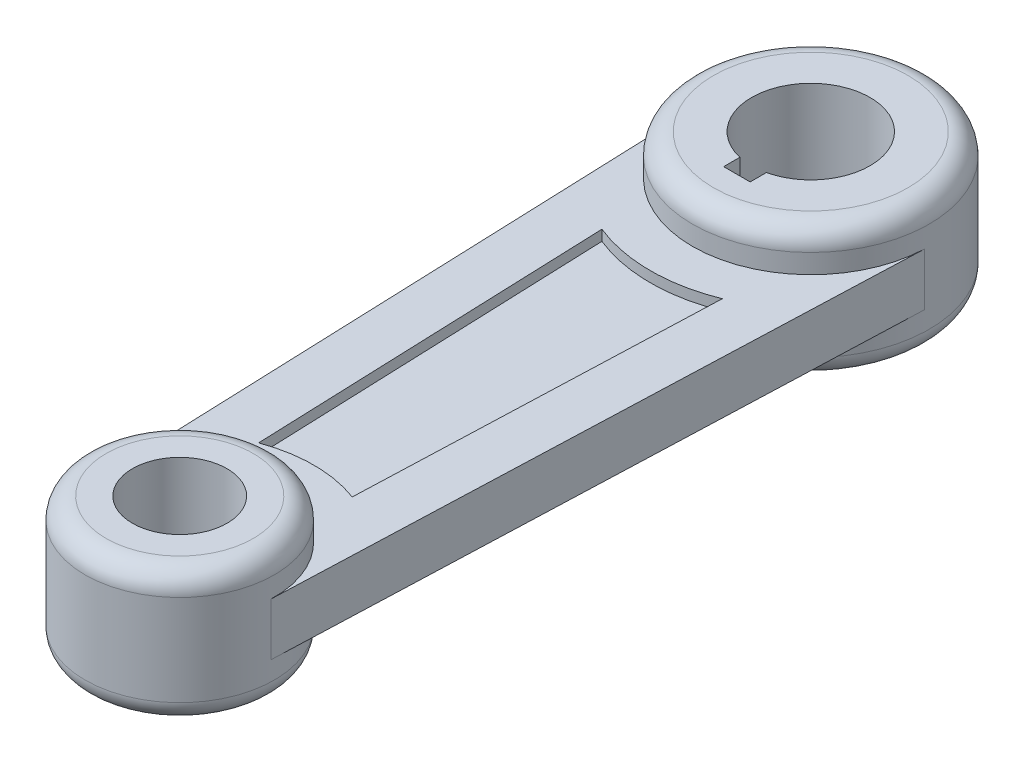
ISO-10303-21;
HEADER;
FILE_DESCRIPTION(('STEP AP214'),'2;1');
FILE_NAME('part.step','',(''),(''),'','','');
FILE_SCHEMA(('AUTOMOTIVE_DESIGN { 1 0 10303 214 1 1 1 1 }'));
ENDSEC;
DATA;
#1=APPLICATION_CONTEXT('core data for automotive mechanical design processes');
#2=APPLICATION_PROTOCOL_DEFINITION('international standard','automotive_design',2000,#1);
#3=PRODUCT_CONTEXT('',#1,'mechanical');
#4=PRODUCT('Part','Part','',(#3));
#5=PRODUCT_RELATED_PRODUCT_CATEGORY('part','',(#4));
#6=PRODUCT_DEFINITION_FORMATION('','',#4);
#7=PRODUCT_DEFINITION_CONTEXT('part definition',#1,'design');
#8=PRODUCT_DEFINITION('design','',#6,#7);
#9=PRODUCT_DEFINITION_SHAPE('','',#8);
#10=(LENGTH_UNIT() NAMED_UNIT(*) SI_UNIT(.MILLI.,.METRE.));
#11=(NAMED_UNIT(*) PLANE_ANGLE_UNIT() SI_UNIT($,.RADIAN.));
#12=(NAMED_UNIT(*) SI_UNIT($,.STERADIAN.) SOLID_ANGLE_UNIT());
#13=UNCERTAINTY_MEASURE_WITH_UNIT(LENGTH_MEASURE(1.E-05),#10,'distance_accuracy_value','');
#14=(GEOMETRIC_REPRESENTATION_CONTEXT(3) GLOBAL_UNCERTAINTY_ASSIGNED_CONTEXT((#13)) GLOBAL_UNIT_ASSIGNED_CONTEXT((#10,
#11,#12)) REPRESENTATION_CONTEXT('',''));
#15=CARTESIAN_POINT('',(0.,0.,0.));
#16=DIRECTION('',(0.,0.,1.));
#17=DIRECTION('',(1.,0.,0.));
#18=AXIS2_PLACEMENT_3D('',#15,#16,#17);
#19=CARTESIAN_POINT('',(0.,-12.5,-300.));
#20=DIRECTION('',(0.,1.,0.));
#21=DIRECTION('',(0.,0.,1.));
#22=AXIS2_PLACEMENT_3D('',#19,#20,#21);
#23=PLANE('',#22);
#24=CARTESIAN_POINT('',(0.,-12.5,-300.));
#25=DIRECTION('',(0.,-1.,0.));
#26=DIRECTION('',(0.,0.,1.));
#27=AXIS2_PLACEMENT_3D('',#24,#25,#26);
#28=CIRCLE('',#27,56.25);
#29=CARTESIAN_POINT('',(56.2104353043932,-12.5,-297.890625));
#30=VERTEX_POINT('',#29);
#31=CARTESIAN_POINT('',(-56.2104353043932,-12.5,-297.890625));
#32=VERTEX_POINT('',#31);
#33=EDGE_CURVE('E184',#30,#32,#28,.T.);
#34=ORIENTED_EDGE('',*,*,#33,.F.);
#35=DIRECTION('',(0.0374999999999999,0.,-0.999296627633657));
#36=VECTOR('',#35,1.);
#37=CARTESIAN_POINT('',(56.2104353043932,-12.5,-297.890625));
#38=LINE('',#37,#36);
#39=CARTESIAN_POINT('',(44.9683482435146,-12.5,1.68749999999999));
#40=VERTEX_POINT('',#39);
#41=EDGE_CURVE('E203',#40,#30,#38,.T.);
#42=ORIENTED_EDGE('',*,*,#41,.F.);
#43=CARTESIAN_POINT('',(0.,-12.5,0.));
#44=DIRECTION('',(0.,-1.,0.));
#45=DIRECTION('',(0.,0.,1.));
#46=AXIS2_PLACEMENT_3D('',#43,#44,#45);
#47=CIRCLE('',#46,45.);
#48=CARTESIAN_POINT('',(-44.9683482435146,-12.5,1.6875));
#49=VERTEX_POINT('',#48);
#50=EDGE_CURVE('E218',#49,#40,#47,.T.);
#51=ORIENTED_EDGE('',*,*,#50,.F.);
#52=DIRECTION('',(0.0374999999999999,0.,0.999296627633657));
#53=VECTOR('',#52,1.);
#54=CARTESIAN_POINT('',(-44.9683482435146,-12.5,1.6875));
#55=LINE('',#54,#53);
#56=EDGE_CURVE('E190',#32,#49,#55,.T.);
#57=ORIENTED_EDGE('',*,*,#56,.F.);
#58=EDGE_LOOP('',(#34,#42,#51,#57));
#59=FACE_BOUND('',#58,.T.);
#60=CARTESIAN_POINT('',(0.,-12.5,0.));
#61=DIRECTION('',(0.,-1.,0.));
#62=DIRECTION('',(0.,0.,1.));
#63=AXIS2_PLACEMENT_3D('',#60,#61,#62);
#64=CIRCLE('',#63,63.75);
#65=CARTESIAN_POINT('',(-22.2558638050738,-12.5,-59.7389238795779));
#66=VERTEX_POINT('',#65);
#67=CARTESIAN_POINT('',(22.2558638050737,-12.5,-59.7389238795779));
#68=VERTEX_POINT('',#67);
#69=EDGE_CURVE('E67',#66,#68,#64,.T.);
#70=ORIENTED_EDGE('',*,*,#69,.T.);
#71=DIRECTION('',(0.0374999999999998,0.,-0.999296627633657));
#72=VECTOR('',#71,1.);
#73=CARTESIAN_POINT('',(22.2558638050737,-12.5,-59.7389238795779));
#74=LINE('',#73,#72);
#75=CARTESIAN_POINT('',(28.6198144116935,-12.5,-229.324907336175));
#76=VERTEX_POINT('',#75);
#77=EDGE_CURVE('E655',#68,#76,#74,.T.);
#78=ORIENTED_EDGE('',*,*,#77,.T.);
#79=CARTESIAN_POINT('',(0.,-12.5,-300.));
#80=DIRECTION('',(0.,-1.,0.));
#81=DIRECTION('',(0.,0.,1.));
#82=AXIS2_PLACEMENT_3D('',#79,#80,#81);
#83=CIRCLE('',#82,76.25);
#84=CARTESIAN_POINT('',(-28.6198144116936,-12.5,-229.324907336175));
#85=VERTEX_POINT('',#84);
#86=EDGE_CURVE('E671',#76,#85,#83,.T.);
#87=ORIENTED_EDGE('',*,*,#86,.T.);
#88=DIRECTION('',(0.0374999999999998,0.,0.999296627633657));
#89=VECTOR('',#88,1.);
#90=CARTESIAN_POINT('',(-28.6198144116936,-12.5,-229.324907336175));
#91=LINE('',#90,#89);
#92=EDGE_CURVE('E667',#85,#66,#91,.T.);
#93=ORIENTED_EDGE('',*,*,#92,.T.);
#94=EDGE_LOOP('',(#70,#78,#87,#93));
#95=FACE_BOUND('',#94,.T.);
#96=ADVANCED_FACE('F43',(#59,#95),#23,.F.);
#97=CARTESIAN_POINT('',(0.,31.65,0.));
#98=DIRECTION('',(0.,1.,0.));
#99=DIRECTION('',(0.,0.,1.));
#100=AXIS2_PLACEMENT_3D('',#97,#98,#99);
#101=PLANE('',#100);
#102=CARTESIAN_POINT('',(0.,31.65,0.));
#103=DIRECTION('',(0.,1.,0.));
#104=DIRECTION('',(0.,0.,1.));
#105=AXIS2_PLACEMENT_3D('',#102,#103,#104);
#106=CIRCLE('',#105,35.);
#107=CARTESIAN_POINT('',(0.,31.65,35.));
#108=VERTEX_POINT('',#107);
#109=EDGE_CURVE('E256',#108,#108,#106,.T.);
#110=ORIENTED_EDGE('',*,*,#109,.T.);
#111=EDGE_LOOP('',(#110));
#112=FACE_BOUND('',#111,.T.);
#113=CARTESIAN_POINT('',(0.,31.65,0.));
#114=DIRECTION('',(0.,1.,0.));
#115=DIRECTION('',(0.,0.,1.));
#116=AXIS2_PLACEMENT_3D('',#113,#114,#115);
#117=CIRCLE('',#116,22.5);
#118=CARTESIAN_POINT('',(0.,31.65,22.5));
#119=VERTEX_POINT('',#118);
#120=EDGE_CURVE('E237',#119,#119,#117,.T.);
#121=ORIENTED_EDGE('',*,*,#120,.F.);
#122=EDGE_LOOP('',(#121));
#123=FACE_BOUND('',#122,.T.);
#124=ADVANCED_FACE('F314',(#112,#123),#101,.T.);
#125=CARTESIAN_POINT('',(0.,-31.65,0.));
#126=DIRECTION('',(0.,1.,0.));
#127=DIRECTION('',(0.,0.,1.));
#128=AXIS2_PLACEMENT_3D('',#125,#126,#127);
#129=PLANE('',#128);
#130=CARTESIAN_POINT('',(0.,-31.65,0.));
#131=DIRECTION('',(0.,1.,0.));
#132=DIRECTION('',(0.,0.,1.));
#133=AXIS2_PLACEMENT_3D('',#130,#131,#132);
#134=CIRCLE('',#133,35.);
#135=CARTESIAN_POINT('',(0.,-31.65,35.));
#136=VERTEX_POINT('',#135);
#137=EDGE_CURVE('E252',#136,#136,#134,.F.);
#138=ORIENTED_EDGE('',*,*,#137,.T.);
#139=EDGE_LOOP('',(#138));
#140=FACE_BOUND('',#139,.T.);
#141=CARTESIAN_POINT('',(0.,-31.65,0.));
#142=DIRECTION('',(0.,1.,0.));
#143=DIRECTION('',(0.,0.,1.));
#144=AXIS2_PLACEMENT_3D('',#141,#142,#143);
#145=CIRCLE('',#144,22.5);
#146=CARTESIAN_POINT('',(0.,-31.65,22.5));
#147=VERTEX_POINT('',#146);
#148=EDGE_CURVE('E236',#147,#147,#145,.T.);
#149=ORIENTED_EDGE('',*,*,#148,.T.);
#150=EDGE_LOOP('',(#149));
#151=FACE_BOUND('',#150,.T.);
#152=ADVANCED_FACE('F305',(#140,#151),#129,.F.);
#153=CARTESIAN_POINT('',(0.,31.65,0.));
#154=DIRECTION('',(0.,-1.,0.));
#155=DIRECTION('',(0.,0.,-1.));
#156=AXIS2_PLACEMENT_3D('',#153,#154,#155);
#157=CYLINDRICAL_SURFACE('',#156,45.);
#158=CARTESIAN_POINT('',(0.,-21.65,0.));
#159=DIRECTION('',(0.,1.,0.));
#160=DIRECTION('',(0.,0.,1.));
#161=AXIS2_PLACEMENT_3D('',#158,#159,#160);
#162=CIRCLE('',#161,45.);
#163=CARTESIAN_POINT('',(0.,-21.65,45.));
#164=VERTEX_POINT('',#163);
#165=EDGE_CURVE('E248',#164,#164,#162,.T.);
#166=ORIENTED_EDGE('',*,*,#165,.T.);
#167=EDGE_LOOP('',(#166));
#168=FACE_BOUND('',#167,.T.);
#169=CARTESIAN_POINT('',(0.,21.65,0.));
#170=DIRECTION('',(0.,1.,0.));
#171=DIRECTION('',(0.,0.,1.));
#172=AXIS2_PLACEMENT_3D('',#169,#170,#171);
#173=CIRCLE('',#172,45.);
#174=CARTESIAN_POINT('',(0.,21.65,45.));
#175=VERTEX_POINT('',#174);
#176=EDGE_CURVE('E241',#175,#175,#173,.F.);
#177=ORIENTED_EDGE('',*,*,#176,.T.);
#178=EDGE_LOOP('',(#177));
#179=FACE_BOUND('',#178,.T.);
#180=DIRECTION('',(0.,-1.,0.));
#181=VECTOR('',#180,1.);
#182=CARTESIAN_POINT('',(44.9683482435146,12.5,1.6875));
#183=LINE('',#182,#181);
#184=CARTESIAN_POINT('',(44.9683482435146,12.5,1.68749999999999));
#185=VERTEX_POINT('',#184);
#186=EDGE_CURVE('E226',#185,#40,#183,.T.);
#187=ORIENTED_EDGE('',*,*,#186,.F.);
#188=CARTESIAN_POINT('',(0.,12.5,0.));
#189=DIRECTION('',(0.,-1.,0.));
#190=DIRECTION('',(0.,0.,1.));
#191=AXIS2_PLACEMENT_3D('',#188,#189,#190);
#192=CIRCLE('',#191,45.);
#193=CARTESIAN_POINT('',(-44.9683482435146,12.5,1.68749999999999));
#194=VERTEX_POINT('',#193);
#195=EDGE_CURVE('E207',#194,#185,#192,.T.);
#196=ORIENTED_EDGE('',*,*,#195,.F.);
#197=DIRECTION('',(0.,-1.,0.));
#198=VECTOR('',#197,1.);
#199=CARTESIAN_POINT('',(-44.9683482435146,12.5,1.6875));
#200=LINE('',#199,#198);
#201=EDGE_CURVE('E230',#194,#49,#200,.T.);
#202=ORIENTED_EDGE('',*,*,#201,.T.);
#203=ORIENTED_EDGE('',*,*,#50,.T.);
#204=EDGE_LOOP('',(#187,#196,#202,#203));
#205=FACE_BOUND('',#204,.T.);
#206=ADVANCED_FACE('F302',(#168,#179,#205),#157,.T.);
#207=CARTESIAN_POINT('',(0.,31.65,0.));
#208=DIRECTION('',(0.,-1.,0.));
#209=DIRECTION('',(0.,0.,-1.));
#210=AXIS2_PLACEMENT_3D('',#207,#208,#209);
#211=CYLINDRICAL_SURFACE('',#210,22.5);
#212=ORIENTED_EDGE('',*,*,#120,.T.);
#213=EDGE_LOOP('',(#212));
#214=FACE_BOUND('',#213,.T.);
#215=ORIENTED_EDGE('',*,*,#148,.F.);
#216=EDGE_LOOP('',(#215));
#217=FACE_BOUND('',#216,.T.);
#218=ADVANCED_FACE('F304',(#214,#217),#211,.F.);
#219=CARTESIAN_POINT('',(-44.9683482435146,12.5,1.6875));
#220=DIRECTION('',(0.999296627633657,0.,-0.0374999999999999));
#221=DIRECTION('',(-0.0374999999999999,0.,-0.999296627633657));
#222=AXIS2_PLACEMENT_3D('',#219,#220,#221);
#223=PLANE('',#222);
#224=ORIENTED_EDGE('',*,*,#56,.T.);
#225=ORIENTED_EDGE('',*,*,#201,.F.);
#226=DIRECTION('',(0.0374999999999999,0.,0.999296627633657));
#227=VECTOR('',#226,1.);
#228=CARTESIAN_POINT('',(-44.9683482435146,12.5,1.6875));
#229=LINE('',#228,#227);
#230=CARTESIAN_POINT('',(-56.2104353043932,12.5,-297.890625));
#231=VERTEX_POINT('',#230);
#232=EDGE_CURVE('E202',#231,#194,#229,.T.);
#233=ORIENTED_EDGE('',*,*,#232,.F.);
#234=DIRECTION('',(0.,-1.,0.));
#235=VECTOR('',#234,1.);
#236=CARTESIAN_POINT('',(-56.2104353043932,12.5,-297.890625));
#237=LINE('',#236,#235);
#238=EDGE_CURVE('E233',#231,#32,#237,.T.);
#239=ORIENTED_EDGE('',*,*,#238,.T.);
#240=EDGE_LOOP('',(#224,#225,#233,#239));
#241=FACE_BOUND('',#240,.T.);
#242=ADVANCED_FACE('F300',(#241),#223,.F.);
#243=CARTESIAN_POINT('',(56.2104353043932,12.5,-297.890625));
#244=DIRECTION('',(-0.999296627633657,0.,-0.0374999999999999));
#245=DIRECTION('',(-0.0374999999999999,0.,0.999296627633657));
#246=AXIS2_PLACEMENT_3D('',#243,#244,#245);
#247=PLANE('',#246);
#248=ORIENTED_EDGE('',*,*,#41,.T.);
#249=DIRECTION('',(0.,-1.,0.));
#250=VECTOR('',#249,1.);
#251=CARTESIAN_POINT('',(56.2104353043932,12.5,-297.890625));
#252=LINE('',#251,#250);
#253=CARTESIAN_POINT('',(56.2104353043932,12.5,-297.890625));
#254=VERTEX_POINT('',#253);
#255=EDGE_CURVE('E213',#254,#30,#252,.T.);
#256=ORIENTED_EDGE('',*,*,#255,.F.);
#257=DIRECTION('',(0.0374999999999999,0.,-0.999296627633657));
#258=VECTOR('',#257,1.);
#259=CARTESIAN_POINT('',(56.2104353043932,12.5,-297.890625));
#260=LINE('',#259,#258);
#261=EDGE_CURVE('E211',#185,#254,#260,.T.);
#262=ORIENTED_EDGE('',*,*,#261,.F.);
#263=ORIENTED_EDGE('',*,*,#186,.T.);
#264=EDGE_LOOP('',(#248,#256,#262,#263));
#265=FACE_BOUND('',#264,.T.);
#266=ADVANCED_FACE('F292',(#265),#247,.F.);
#267=CARTESIAN_POINT('',(0.,12.5,-300.));
#268=DIRECTION('',(0.,1.,0.));
#269=DIRECTION('',(0.,0.,1.));
#270=AXIS2_PLACEMENT_3D('',#267,#268,#269);
#271=PLANE('',#270);
#272=CARTESIAN_POINT('',(0.,12.5,0.));
#273=DIRECTION('',(0.,-1.,0.));
#274=DIRECTION('',(0.,0.,1.));
#275=AXIS2_PLACEMENT_3D('',#272,#273,#274);
#276=CIRCLE('',#275,63.75);
#277=CARTESIAN_POINT('',(-22.2558638050738,12.5,-59.7389238795779));
#278=VERTEX_POINT('',#277);
#279=CARTESIAN_POINT('',(22.2558638050737,12.5,-59.7389238795779));
#280=VERTEX_POINT('',#279);
#281=EDGE_CURVE('E681',#278,#280,#276,.T.);
#282=ORIENTED_EDGE('',*,*,#281,.F.);
#283=DIRECTION('',(0.0374999999999998,0.,0.999296627633657));
#284=VECTOR('',#283,1.);
#285=CARTESIAN_POINT('',(-28.6198144116936,12.5,-229.324907336175));
#286=LINE('',#285,#284);
#287=CARTESIAN_POINT('',(-28.6198144116936,12.5,-229.324907336175));
#288=VERTEX_POINT('',#287);
#289=EDGE_CURVE('E695',#288,#278,#286,.T.);
#290=ORIENTED_EDGE('',*,*,#289,.F.);
#291=CARTESIAN_POINT('',(0.,12.5,-300.));
#292=DIRECTION('',(0.,-1.,0.));
#293=DIRECTION('',(0.,0.,1.));
#294=AXIS2_PLACEMENT_3D('',#291,#292,#293);
#295=CIRCLE('',#294,76.25);
#296=CARTESIAN_POINT('',(28.6198144116935,12.5,-229.324907336175));
#297=VERTEX_POINT('',#296);
#298=EDGE_CURVE('E713',#297,#288,#295,.T.);
#299=ORIENTED_EDGE('',*,*,#298,.F.);
#300=DIRECTION('',(0.0374999999999998,0.,-0.999296627633657));
#301=VECTOR('',#300,1.);
#302=CARTESIAN_POINT('',(22.2558638050737,12.5,-59.7389238795779));
#303=LINE('',#302,#301);
#304=EDGE_CURVE('E709',#280,#297,#303,.T.);
#305=ORIENTED_EDGE('',*,*,#304,.F.);
#306=EDGE_LOOP('',(#282,#290,#299,#305));
#307=FACE_BOUND('',#306,.T.);
#308=CARTESIAN_POINT('',(0.,12.5,-300.));
#309=DIRECTION('',(0.,-1.,0.));
#310=DIRECTION('',(0.,0.,1.));
#311=AXIS2_PLACEMENT_3D('',#308,#309,#310);
#312=CIRCLE('',#311,56.25);
#313=EDGE_CURVE('E198',#254,#231,#312,.T.);
#314=ORIENTED_EDGE('',*,*,#313,.T.);
#315=ORIENTED_EDGE('',*,*,#232,.T.);
#316=ORIENTED_EDGE('',*,*,#195,.T.);
#317=ORIENTED_EDGE('',*,*,#261,.T.);
#318=EDGE_LOOP('',(#314,#315,#316,#317));
#319=FACE_BOUND('',#318,.T.);
#320=ADVANCED_FACE('F288',(#307,#319),#271,.T.);
#321=CARTESIAN_POINT('',(0.,31.65,-300.));
#322=DIRECTION('',(0.,1.,0.));
#323=DIRECTION('',(0.,0.,1.));
#324=AXIS2_PLACEMENT_3D('',#321,#322,#323);
#325=PLANE('',#324);
#326=CARTESIAN_POINT('',(0.,31.65,-300.));
#327=DIRECTION('',(0.,1.,0.));
#328=DIRECTION('',(0.,0.,1.));
#329=AXIS2_PLACEMENT_3D('',#326,#327,#328);
#330=CIRCLE('',#329,46.25);
#331=CARTESIAN_POINT('',(0.,31.65,-253.75));
#332=VERTEX_POINT('',#331);
#333=EDGE_CURVE('E12',#332,#332,#330,.T.);
#334=ORIENTED_EDGE('',*,*,#333,.T.);
#335=EDGE_LOOP('',(#334));
#336=FACE_BOUND('',#335,.T.);
#337=DIRECTION('',(0.,0.,-1.));
#338=VECTOR('',#337,1.);
#339=CARTESIAN_POINT('',(6.3,31.65,-272.564029085888));
#340=LINE('',#339,#338);
#341=CARTESIAN_POINT('',(6.3,31.65,-264.864029085888));
#342=VERTEX_POINT('',#341);
#343=CARTESIAN_POINT('',(6.3,31.65,-272.564029085888));
#344=VERTEX_POINT('',#343);
#345=EDGE_CURVE('E165',#342,#344,#340,.T.);
#346=ORIENTED_EDGE('',*,*,#345,.F.);
#347=DIRECTION('',(1.,0.,0.));
#348=VECTOR('',#347,1.);
#349=CARTESIAN_POINT('',(-6.3,31.65,-264.864029085888));
#350=LINE('',#349,#348);
#351=CARTESIAN_POINT('',(-6.3,31.65,-264.864029085888));
#352=VERTEX_POINT('',#351);
#353=EDGE_CURVE('E180',#352,#342,#350,.T.);
#354=ORIENTED_EDGE('',*,*,#353,.F.);
#355=DIRECTION('',(0.,0.,1.));
#356=VECTOR('',#355,1.);
#357=CARTESIAN_POINT('',(-6.3,31.65,-272.564029085888));
#358=LINE('',#357,#356);
#359=CARTESIAN_POINT('',(-6.3,31.65,-272.564029085888));
#360=VERTEX_POINT('',#359);
#361=EDGE_CURVE('E632',#360,#352,#358,.T.);
#362=ORIENTED_EDGE('',*,*,#361,.F.);
#363=CARTESIAN_POINT('',(0.,31.65,-300.));
#364=DIRECTION('',(0.,1.,0.));
#365=DIRECTION('',(0.,0.,1.));
#366=AXIS2_PLACEMENT_3D('',#363,#364,#365);
#367=CIRCLE('',#366,28.15);
#368=EDGE_CURVE('E185',#344,#360,#367,.T.);
#369=ORIENTED_EDGE('',*,*,#368,.F.);
#370=EDGE_LOOP('',(#346,#354,#362,#369));
#371=FACE_BOUND('',#370,.T.);
#372=ADVANCED_FACE('F346',(#336,#371),#325,.T.);
#373=CARTESIAN_POINT('',(0.,-31.65,-300.));
#374=DIRECTION('',(0.,1.,0.));
#375=DIRECTION('',(0.,0.,1.));
#376=AXIS2_PLACEMENT_3D('',#373,#374,#375);
#377=PLANE('',#376);
#378=CARTESIAN_POINT('',(0.,-31.65,-300.));
#379=DIRECTION('',(0.,1.,0.));
#380=DIRECTION('',(0.,0.,1.));
#381=AXIS2_PLACEMENT_3D('',#378,#379,#380);
#382=CIRCLE('',#381,46.25);
#383=CARTESIAN_POINT('',(0.,-31.65,-253.75));
#384=VERTEX_POINT('',#383);
#385=EDGE_CURVE('E52',#384,#384,#382,.F.);
#386=ORIENTED_EDGE('',*,*,#385,.T.);
#387=EDGE_LOOP('',(#386));
#388=FACE_BOUND('',#387,.T.);
#389=DIRECTION('',(1.,0.,0.));
#390=VECTOR('',#389,1.);
#391=CARTESIAN_POINT('',(-6.3,-31.65,-264.864029085888));
#392=LINE('',#391,#390);
#393=CARTESIAN_POINT('',(-6.3,-31.65,-264.864029085888));
#394=VERTEX_POINT('',#393);
#395=CARTESIAN_POINT('',(6.3,-31.65,-264.864029085888));
#396=VERTEX_POINT('',#395);
#397=EDGE_CURVE('E172',#394,#396,#392,.T.);
#398=ORIENTED_EDGE('',*,*,#397,.T.);
#399=DIRECTION('',(0.,0.,-1.));
#400=VECTOR('',#399,1.);
#401=CARTESIAN_POINT('',(6.3,-31.65,-272.564029085888));
#402=LINE('',#401,#400);
#403=CARTESIAN_POINT('',(6.3,-31.65,-272.564029085888));
#404=VERTEX_POINT('',#403);
#405=EDGE_CURVE('E162',#396,#404,#402,.T.);
#406=ORIENTED_EDGE('',*,*,#405,.T.);
#407=CARTESIAN_POINT('',(0.,-31.65,-300.));
#408=DIRECTION('',(0.,1.,0.));
#409=DIRECTION('',(0.,0.,1.));
#410=AXIS2_PLACEMENT_3D('',#407,#408,#409);
#411=CIRCLE('',#410,28.15);
#412=CARTESIAN_POINT('',(-6.30000000000001,-31.65,-272.564029085888));
#413=VERTEX_POINT('',#412);
#414=EDGE_CURVE('E177',#404,#413,#411,.T.);
#415=ORIENTED_EDGE('',*,*,#414,.T.);
#416=DIRECTION('',(0.,0.,1.));
#417=VECTOR('',#416,1.);
#418=CARTESIAN_POINT('',(-6.3,-31.65,-272.564029085888));
#419=LINE('',#418,#417);
#420=EDGE_CURVE('E59',#413,#394,#419,.T.);
#421=ORIENTED_EDGE('',*,*,#420,.T.);
#422=EDGE_LOOP('',(#398,#406,#415,#421));
#423=FACE_BOUND('',#422,.T.);
#424=ADVANCED_FACE('F176',(#388,#423),#377,.F.);
#425=CARTESIAN_POINT('',(0.,31.65,-300.));
#426=DIRECTION('',(0.,-1.,0.));
#427=DIRECTION('',(0.,0.,-1.));
#428=AXIS2_PLACEMENT_3D('',#425,#426,#427);
#429=CYLINDRICAL_SURFACE('',#428,56.25);
#430=CARTESIAN_POINT('',(0.,-21.65,-300.));
#431=DIRECTION('',(0.,1.,0.));
#432=DIRECTION('',(0.,0.,1.));
#433=AXIS2_PLACEMENT_3D('',#430,#431,#432);
#434=CIRCLE('',#433,56.25);
#435=CARTESIAN_POINT('',(0.,-21.65,-243.75));
#436=VERTEX_POINT('',#435);
#437=EDGE_CURVE('E264',#436,#436,#434,.T.);
#438=ORIENTED_EDGE('',*,*,#437,.T.);
#439=EDGE_LOOP('',(#438));
#440=FACE_BOUND('',#439,.T.);
#441=CARTESIAN_POINT('',(0.,21.65,-300.));
#442=DIRECTION('',(0.,1.,0.));
#443=DIRECTION('',(0.,0.,1.));
#444=AXIS2_PLACEMENT_3D('',#441,#442,#443);
#445=CIRCLE('',#444,56.25);
#446=CARTESIAN_POINT('',(0.,21.65,-243.75));
#447=VERTEX_POINT('',#446);
#448=EDGE_CURVE('E260',#447,#447,#445,.F.);
#449=ORIENTED_EDGE('',*,*,#448,.T.);
#450=EDGE_LOOP('',(#449));
#451=FACE_BOUND('',#450,.T.);
#452=ORIENTED_EDGE('',*,*,#313,.F.);
#453=ORIENTED_EDGE('',*,*,#255,.T.);
#454=ORIENTED_EDGE('',*,*,#33,.T.);
#455=ORIENTED_EDGE('',*,*,#238,.F.);
#456=EDGE_LOOP('',(#452,#453,#454,#455));
#457=FACE_BOUND('',#456,.T.);
#458=ADVANCED_FACE('F278',(#440,#451,#457),#429,.T.);
#459=CARTESIAN_POINT('',(0.,31.65,-300.));
#460=DIRECTION('',(0.,-1.,0.));
#461=DIRECTION('',(0.,0.,-1.));
#462=AXIS2_PLACEMENT_3D('',#459,#460,#461);
#463=CYLINDRICAL_SURFACE('',#462,28.15);
#464=DIRECTION('',(0.,1.,0.));
#465=VECTOR('',#464,1.);
#466=CARTESIAN_POINT('',(6.3,-31.65,-272.564029085888));
#467=LINE('',#466,#465);
#468=EDGE_CURVE('E159',#404,#344,#467,.T.);
#469=ORIENTED_EDGE('',*,*,#468,.T.);
#470=ORIENTED_EDGE('',*,*,#368,.T.);
#471=DIRECTION('',(0.,1.,0.));
#472=VECTOR('',#471,1.);
#473=CARTESIAN_POINT('',(-6.3,-31.65,-272.564029085888));
#474=LINE('',#473,#472);
#475=EDGE_CURVE('E171',#413,#360,#474,.T.);
#476=ORIENTED_EDGE('',*,*,#475,.F.);
#477=ORIENTED_EDGE('',*,*,#414,.F.);
#478=EDGE_LOOP('',(#469,#470,#476,#477));
#479=FACE_BOUND('',#478,.T.);
#480=ADVANCED_FACE('F182',(#479),#463,.F.);
#481=CARTESIAN_POINT('',(0.,7.5,0.));
#482=DIRECTION('',(0.,1.,0.));
#483=DIRECTION('',(0.,0.,1.));
#484=AXIS2_PLACEMENT_3D('',#481,#482,#483);
#485=CYLINDRICAL_SURFACE('',#484,63.75);
#486=ORIENTED_EDGE('',*,*,#281,.T.);
#487=DIRECTION('',(0.,1.,0.));
#488=VECTOR('',#487,1.);
#489=CARTESIAN_POINT('',(22.2558638050737,7.5,-59.7389238795779));
#490=LINE('',#489,#488);
#491=CARTESIAN_POINT('',(22.2558638050737,7.5,-59.7389238795779));
#492=VERTEX_POINT('',#491);
#493=EDGE_CURVE('E195',#492,#280,#490,.T.);
#494=ORIENTED_EDGE('',*,*,#493,.F.);
#495=CARTESIAN_POINT('',(0.,7.5,0.));
#496=DIRECTION('',(0.,-1.,0.));
#497=DIRECTION('',(0.,0.,1.));
#498=AXIS2_PLACEMENT_3D('',#495,#496,#497);
#499=CIRCLE('',#498,63.75);
#500=CARTESIAN_POINT('',(-22.2558638050738,7.5,-59.7389238795779));
#501=VERTEX_POINT('',#500);
#502=EDGE_CURVE('E690',#501,#492,#499,.T.);
#503=ORIENTED_EDGE('',*,*,#502,.F.);
#504=DIRECTION('',(0.,1.,0.));
#505=VECTOR('',#504,1.);
#506=CARTESIAN_POINT('',(-22.2558638050738,7.5,-59.7389238795779));
#507=LINE('',#506,#505);
#508=EDGE_CURVE('E192',#501,#278,#507,.T.);
#509=ORIENTED_EDGE('',*,*,#508,.T.);
#510=EDGE_LOOP('',(#486,#494,#503,#509));
#511=FACE_BOUND('',#510,.T.);
#512=ADVANCED_FACE('F372',(#511),#485,.T.);
#513=CARTESIAN_POINT('',(-28.6198144116936,7.5,-229.324907336175));
#514=DIRECTION('',(-0.999296627633657,0.,0.0374999999999998));
#515=DIRECTION('',(0.0374999999999998,0.,0.999296627633657));
#516=AXIS2_PLACEMENT_3D('',#513,#514,#515);
#517=PLANE('',#516);
#518=ORIENTED_EDGE('',*,*,#289,.T.);
#519=ORIENTED_EDGE('',*,*,#508,.F.);
#520=DIRECTION('',(0.0374999999999998,0.,0.999296627633657));
#521=VECTOR('',#520,1.);
#522=CARTESIAN_POINT('',(-28.6198144116936,7.5,-229.324907336175));
#523=LINE('',#522,#521);
#524=CARTESIAN_POINT('',(-28.6198144116936,7.5,-229.324907336175));
#525=VERTEX_POINT('',#524);
#526=EDGE_CURVE('E703',#525,#501,#523,.T.);
#527=ORIENTED_EDGE('',*,*,#526,.F.);
#528=DIRECTION('',(0.,1.,0.));
#529=VECTOR('',#528,1.);
#530=CARTESIAN_POINT('',(-28.6198144116936,7.5,-229.324907336175));
#531=LINE('',#530,#529);
#532=EDGE_CURVE('E722',#525,#288,#531,.T.);
#533=ORIENTED_EDGE('',*,*,#532,.T.);
#534=EDGE_LOOP('',(#518,#519,#527,#533));
#535=FACE_BOUND('',#534,.T.);
#536=ADVANCED_FACE('F379',(#535),#517,.F.);
#537=CARTESIAN_POINT('',(0.,7.5,-300.));
#538=DIRECTION('',(0.,1.,0.));
#539=DIRECTION('',(0.,0.,1.));
#540=AXIS2_PLACEMENT_3D('',#537,#538,#539);
#541=CYLINDRICAL_SURFACE('',#540,76.25);
#542=ORIENTED_EDGE('',*,*,#298,.T.);
#543=ORIENTED_EDGE('',*,*,#532,.F.);
#544=CARTESIAN_POINT('',(0.,7.5,-300.));
#545=DIRECTION('',(0.,-1.,0.));
#546=DIRECTION('',(0.,0.,1.));
#547=AXIS2_PLACEMENT_3D('',#544,#545,#546);
#548=CIRCLE('',#547,76.25);
#549=CARTESIAN_POINT('',(28.6198144116935,7.5,-229.324907336175));
#550=VERTEX_POINT('',#549);
#551=EDGE_CURVE('E699',#550,#525,#548,.T.);
#552=ORIENTED_EDGE('',*,*,#551,.F.);
#553=DIRECTION('',(0.,1.,0.));
#554=VECTOR('',#553,1.);
#555=CARTESIAN_POINT('',(28.6198144116935,7.5,-229.324907336175));
#556=LINE('',#555,#554);
#557=EDGE_CURVE('E724',#550,#297,#556,.T.);
#558=ORIENTED_EDGE('',*,*,#557,.T.);
#559=EDGE_LOOP('',(#542,#543,#552,#558));
#560=FACE_BOUND('',#559,.T.);
#561=ADVANCED_FACE('F387',(#560),#541,.T.);
#562=CARTESIAN_POINT('',(22.2558638050737,7.5,-59.7389238795779));
#563=DIRECTION('',(0.999296627633657,0.,0.0374999999999998));
#564=DIRECTION('',(0.0374999999999998,0.,-0.999296627633657));
#565=AXIS2_PLACEMENT_3D('',#562,#563,#564);
#566=PLANE('',#565);
#567=ORIENTED_EDGE('',*,*,#304,.T.);
#568=ORIENTED_EDGE('',*,*,#557,.F.);
#569=DIRECTION('',(0.0374999999999998,0.,-0.999296627633657));
#570=VECTOR('',#569,1.);
#571=CARTESIAN_POINT('',(22.2558638050737,7.5,-59.7389238795779));
#572=LINE('',#571,#570);
#573=EDGE_CURVE('E694',#492,#550,#572,.T.);
#574=ORIENTED_EDGE('',*,*,#573,.F.);
#575=ORIENTED_EDGE('',*,*,#493,.T.);
#576=EDGE_LOOP('',(#567,#568,#574,#575));
#577=FACE_BOUND('',#576,.T.);
#578=ADVANCED_FACE('F395',(#577),#566,.F.);
#579=CARTESIAN_POINT('',(0.,7.5,0.));
#580=DIRECTION('',(0.,1.,0.));
#581=DIRECTION('',(0.,0.,1.));
#582=AXIS2_PLACEMENT_3D('',#579,#580,#581);
#583=PLANE('',#582);
#584=ORIENTED_EDGE('',*,*,#502,.T.);
#585=ORIENTED_EDGE('',*,*,#573,.T.);
#586=ORIENTED_EDGE('',*,*,#551,.T.);
#587=ORIENTED_EDGE('',*,*,#526,.T.);
#588=EDGE_LOOP('',(#584,#585,#586,#587));
#589=FACE_BOUND('',#588,.T.);
#590=ADVANCED_FACE('F403',(#589),#583,.T.);
#591=CARTESIAN_POINT('',(0.,-7.5,0.));
#592=DIRECTION('',(0.,-1.,0.));
#593=DIRECTION('',(0.,0.,-1.));
#594=AXIS2_PLACEMENT_3D('',#591,#592,#593);
#595=CYLINDRICAL_SURFACE('',#594,63.75);
#596=ORIENTED_EDGE('',*,*,#69,.F.);
#597=DIRECTION('',(0.,-1.,0.));
#598=VECTOR('',#597,1.);
#599=CARTESIAN_POINT('',(-22.2558638050738,-7.5,-59.7389238795779));
#600=LINE('',#599,#598);
#601=CARTESIAN_POINT('',(-22.2558638050738,-7.5,-59.7389238795779));
#602=VERTEX_POINT('',#601);
#603=EDGE_CURVE('E664',#602,#66,#600,.T.);
#604=ORIENTED_EDGE('',*,*,#603,.F.);
#605=CARTESIAN_POINT('',(0.,-7.5,0.));
#606=DIRECTION('',(0.,-1.,0.));
#607=DIRECTION('',(0.,0.,1.));
#608=AXIS2_PLACEMENT_3D('',#605,#606,#607);
#609=CIRCLE('',#608,63.75);
#610=CARTESIAN_POINT('',(22.2558638050737,-7.5,-59.7389238795779));
#611=VERTEX_POINT('',#610);
#612=EDGE_CURVE('E650',#602,#611,#609,.T.);
#613=ORIENTED_EDGE('',*,*,#612,.T.);
#614=DIRECTION('',(0.,-1.,0.));
#615=VECTOR('',#614,1.);
#616=CARTESIAN_POINT('',(22.2558638050737,-7.5,-59.7389238795779));
#617=LINE('',#616,#615);
#618=EDGE_CURVE('E678',#611,#68,#617,.T.);
#619=ORIENTED_EDGE('',*,*,#618,.T.);
#620=EDGE_LOOP('',(#596,#604,#613,#619));
#621=FACE_BOUND('',#620,.T.);
#622=ADVANCED_FACE('F411',(#621),#595,.T.);
#623=CARTESIAN_POINT('',(22.2558638050737,-7.5,-59.7389238795779));
#624=DIRECTION('',(-0.999296627633657,0.,-0.0374999999999998));
#625=DIRECTION('',(-0.0374999999999998,0.,0.999296627633657));
#626=AXIS2_PLACEMENT_3D('',#623,#624,#625);
#627=PLANE('',#626);
#628=ORIENTED_EDGE('',*,*,#77,.F.);
#629=ORIENTED_EDGE('',*,*,#618,.F.);
#630=DIRECTION('',(0.0374999999999998,0.,-0.999296627633657));
#631=VECTOR('',#630,1.);
#632=CARTESIAN_POINT('',(22.2558638050737,-7.5,-59.7389238795779));
#633=LINE('',#632,#631);
#634=CARTESIAN_POINT('',(28.6198144116935,-7.5,-229.324907336175));
#635=VERTEX_POINT('',#634);
#636=EDGE_CURVE('E661',#611,#635,#633,.T.);
#637=ORIENTED_EDGE('',*,*,#636,.T.);
#638=DIRECTION('',(0.,-1.,0.));
#639=VECTOR('',#638,1.);
#640=CARTESIAN_POINT('',(28.6198144116935,-7.5,-229.324907336175));
#641=LINE('',#640,#639);
#642=EDGE_CURVE('E682',#635,#76,#641,.T.);
#643=ORIENTED_EDGE('',*,*,#642,.T.);
#644=EDGE_LOOP('',(#628,#629,#637,#643));
#645=FACE_BOUND('',#644,.T.);
#646=ADVANCED_FACE('F419',(#645),#627,.T.);
#647=CARTESIAN_POINT('',(0.,-7.5,-300.));
#648=DIRECTION('',(0.,-1.,0.));
#649=DIRECTION('',(0.,0.,-1.));
#650=AXIS2_PLACEMENT_3D('',#647,#648,#649);
#651=CYLINDRICAL_SURFACE('',#650,76.25);
#652=ORIENTED_EDGE('',*,*,#86,.F.);
#653=ORIENTED_EDGE('',*,*,#642,.F.);
#654=CARTESIAN_POINT('',(0.,-7.5,-300.));
#655=DIRECTION('',(0.,-1.,0.));
#656=DIRECTION('',(0.,0.,1.));
#657=AXIS2_PLACEMENT_3D('',#654,#655,#656);
#658=CIRCLE('',#657,76.25);
#659=CARTESIAN_POINT('',(-28.6198144116936,-7.5,-229.324907336175));
#660=VERTEX_POINT('',#659);
#661=EDGE_CURVE('E658',#635,#660,#658,.T.);
#662=ORIENTED_EDGE('',*,*,#661,.T.);
#663=DIRECTION('',(0.,-1.,0.));
#664=VECTOR('',#663,1.);
#665=CARTESIAN_POINT('',(-28.6198144116936,-7.5,-229.324907336175));
#666=LINE('',#665,#664);
#667=EDGE_CURVE('E685',#660,#85,#666,.T.);
#668=ORIENTED_EDGE('',*,*,#667,.T.);
#669=EDGE_LOOP('',(#652,#653,#662,#668));
#670=FACE_BOUND('',#669,.T.);
#671=ADVANCED_FACE('F426',(#670),#651,.T.);
#672=CARTESIAN_POINT('',(-28.6198144116936,-7.5,-229.324907336175));
#673=DIRECTION('',(0.999296627633657,0.,-0.0374999999999998));
#674=DIRECTION('',(-0.0374999999999998,0.,-0.999296627633657));
#675=AXIS2_PLACEMENT_3D('',#672,#673,#674);
#676=PLANE('',#675);
#677=ORIENTED_EDGE('',*,*,#92,.F.);
#678=ORIENTED_EDGE('',*,*,#667,.F.);
#679=DIRECTION('',(0.0374999999999998,0.,0.999296627633657));
#680=VECTOR('',#679,1.);
#681=CARTESIAN_POINT('',(-28.6198144116936,-7.5,-229.324907336175));
#682=LINE('',#681,#680);
#683=EDGE_CURVE('E654',#660,#602,#682,.T.);
#684=ORIENTED_EDGE('',*,*,#683,.T.);
#685=ORIENTED_EDGE('',*,*,#603,.T.);
#686=EDGE_LOOP('',(#677,#678,#684,#685));
#687=FACE_BOUND('',#686,.T.);
#688=ADVANCED_FACE('F434',(#687),#676,.T.);
#689=CARTESIAN_POINT('',(0.,-7.5,0.));
#690=DIRECTION('',(0.,-1.,0.));
#691=DIRECTION('',(0.,0.,1.));
#692=AXIS2_PLACEMENT_3D('',#689,#690,#691);
#693=PLANE('',#692);
#694=ORIENTED_EDGE('',*,*,#612,.F.);
#695=ORIENTED_EDGE('',*,*,#683,.F.);
#696=ORIENTED_EDGE('',*,*,#661,.F.);
#697=ORIENTED_EDGE('',*,*,#636,.F.);
#698=EDGE_LOOP('',(#694,#695,#696,#697));
#699=FACE_BOUND('',#698,.T.);
#700=ADVANCED_FACE('F442',(#699),#693,.T.);
#701=CARTESIAN_POINT('',(6.3,-31.65,-272.564029085888));
#702=DIRECTION('',(1.,0.,0.));
#703=DIRECTION('',(0.,0.,-1.));
#704=AXIS2_PLACEMENT_3D('',#701,#702,#703);
#705=PLANE('',#704);
#706=ORIENTED_EDGE('',*,*,#345,.T.);
#707=ORIENTED_EDGE('',*,*,#468,.F.);
#708=ORIENTED_EDGE('',*,*,#405,.F.);
#709=DIRECTION('',(0.,1.,0.));
#710=VECTOR('',#709,1.);
#711=CARTESIAN_POINT('',(6.3,-31.65,-264.864029085888));
#712=LINE('',#711,#710);
#713=EDGE_CURVE('E642',#396,#342,#712,.T.);
#714=ORIENTED_EDGE('',*,*,#713,.T.);
#715=EDGE_LOOP('',(#706,#707,#708,#714));
#716=FACE_BOUND('',#715,.T.);
#717=ADVANCED_FACE('F161',(#716),#705,.F.);
#718=CARTESIAN_POINT('',(-6.3,-31.65,-264.864029085888));
#719=DIRECTION('',(0.,0.,1.));
#720=DIRECTION('',(1.,0.,0.));
#721=AXIS2_PLACEMENT_3D('',#718,#719,#720);
#722=PLANE('',#721);
#723=ORIENTED_EDGE('',*,*,#353,.T.);
#724=ORIENTED_EDGE('',*,*,#713,.F.);
#725=ORIENTED_EDGE('',*,*,#397,.F.);
#726=DIRECTION('',(0.,1.,0.));
#727=VECTOR('',#726,1.);
#728=CARTESIAN_POINT('',(-6.3,-31.65,-264.864029085888));
#729=LINE('',#728,#727);
#730=EDGE_CURVE('E645',#394,#352,#729,.T.);
#731=ORIENTED_EDGE('',*,*,#730,.T.);
#732=EDGE_LOOP('',(#723,#724,#725,#731));
#733=FACE_BOUND('',#732,.T.);
#734=ADVANCED_FACE('F455',(#733),#722,.F.);
#735=CARTESIAN_POINT('',(-6.3,-31.65,-272.564029085888));
#736=DIRECTION('',(-1.,0.,0.));
#737=DIRECTION('',(0.,0.,1.));
#738=AXIS2_PLACEMENT_3D('',#735,#736,#737);
#739=PLANE('',#738);
#740=ORIENTED_EDGE('',*,*,#361,.T.);
#741=ORIENTED_EDGE('',*,*,#730,.F.);
#742=ORIENTED_EDGE('',*,*,#420,.F.);
#743=ORIENTED_EDGE('',*,*,#475,.T.);
#744=EDGE_LOOP('',(#740,#741,#742,#743));
#745=FACE_BOUND('',#744,.T.);
#746=ADVANCED_FACE('F462',(#745),#739,.F.);
#747=CARTESIAN_POINT('',(0.,-21.65,0.));
#748=DIRECTION('',(0.,1.,0.));
#749=DIRECTION('',(0.,0.,1.));
#750=AXIS2_PLACEMENT_3D('',#747,#748,#749);
#751=TOROIDAL_SURFACE('',#750,35.,10.);
#752=ORIENTED_EDGE('',*,*,#137,.F.);
#753=EDGE_LOOP('',(#752));
#754=FACE_BOUND('',#753,.T.);
#755=ORIENTED_EDGE('',*,*,#165,.F.);
#756=EDGE_LOOP('',(#755));
#757=FACE_BOUND('',#756,.T.);
#758=ADVANCED_FACE('F470',(#754,#757),#751,.T.);
#759=CARTESIAN_POINT('',(0.,21.65,0.));
#760=DIRECTION('',(0.,1.,0.));
#761=DIRECTION('',(0.,0.,1.));
#762=AXIS2_PLACEMENT_3D('',#759,#760,#761);
#763=TOROIDAL_SURFACE('',#762,35.,10.);
#764=ORIENTED_EDGE('',*,*,#176,.F.);
#765=EDGE_LOOP('',(#764));
#766=FACE_BOUND('',#765,.T.);
#767=ORIENTED_EDGE('',*,*,#109,.F.);
#768=EDGE_LOOP('',(#767));
#769=FACE_BOUND('',#768,.T.);
#770=ADVANCED_FACE('F275',(#766,#769),#763,.T.);
#771=CARTESIAN_POINT('',(0.,-21.65,-300.));
#772=DIRECTION('',(0.,1.,0.));
#773=DIRECTION('',(0.,0.,1.));
#774=AXIS2_PLACEMENT_3D('',#771,#772,#773);
#775=TOROIDAL_SURFACE('',#774,46.25,10.);
#776=ORIENTED_EDGE('',*,*,#385,.F.);
#777=EDGE_LOOP('',(#776));
#778=FACE_BOUND('',#777,.T.);
#779=ORIENTED_EDGE('',*,*,#437,.F.);
#780=EDGE_LOOP('',(#779));
#781=FACE_BOUND('',#780,.T.);
#782=ADVANCED_FACE('F272',(#778,#781),#775,.T.);
#783=CARTESIAN_POINT('',(0.,21.65,-300.));
#784=DIRECTION('',(0.,1.,0.));
#785=DIRECTION('',(0.,0.,1.));
#786=AXIS2_PLACEMENT_3D('',#783,#784,#785);
#787=TOROIDAL_SURFACE('',#786,46.25,10.);
#788=ORIENTED_EDGE('',*,*,#448,.F.);
#789=EDGE_LOOP('',(#788));
#790=FACE_BOUND('',#789,.T.);
#791=ORIENTED_EDGE('',*,*,#333,.F.);
#792=EDGE_LOOP('',(#791));
#793=FACE_BOUND('',#792,.T.);
#794=ADVANCED_FACE('F45',(#790,#793),#787,.T.);
#795=CLOSED_SHELL('',(#96,#124,#152,#206,#218,#242,#266,#320,#372,#424,#458,#480,#512,#536,#561,
#578,#590,#622,#646,#671,#688,#700,#717,#734,#746,#758,#770,#782,#794));
#796=MANIFOLD_SOLID_BREP('B2',#795);
#797=ADVANCED_BREP_SHAPE_REPRESENTATION('',(#18,#796),#14);
#798=SHAPE_DEFINITION_REPRESENTATION(#9,#797);
ENDSEC;
END-ISO-10303-21;
